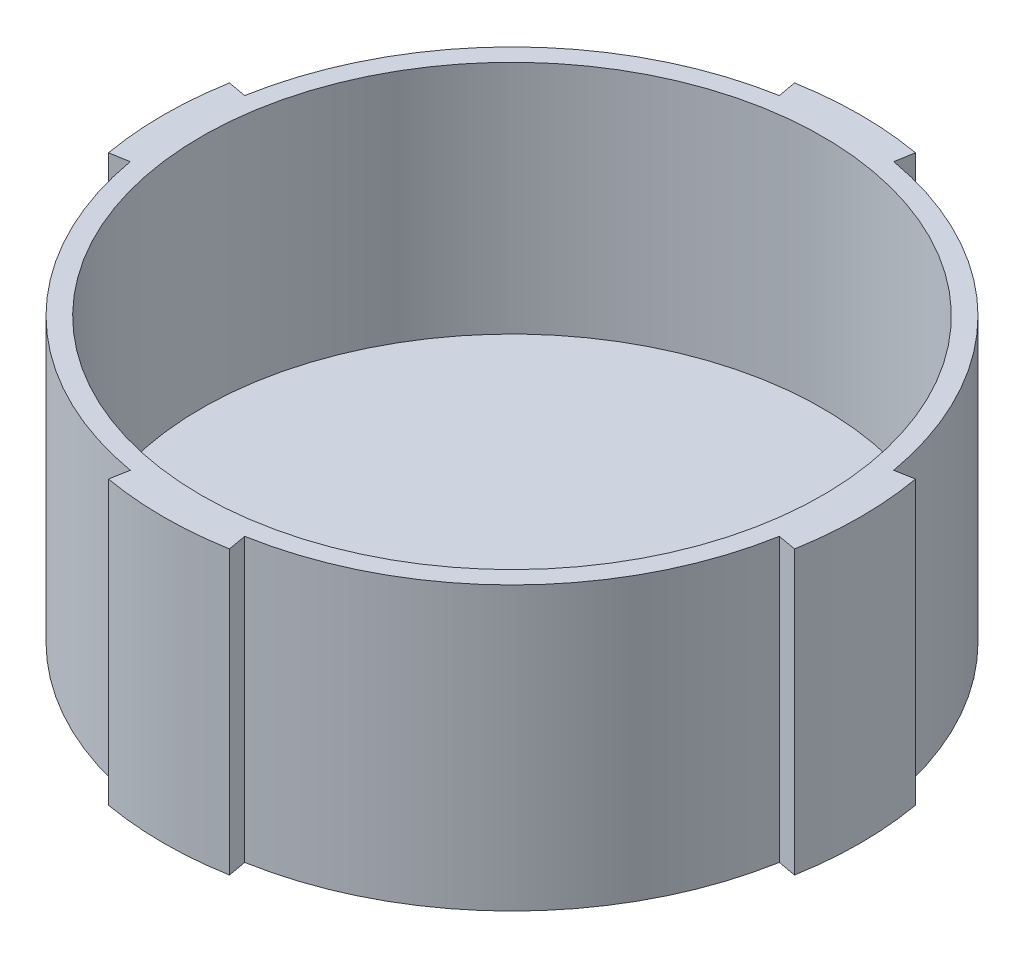
ISO-10303-21;
HEADER;
FILE_DESCRIPTION(('STEP AP214'),'2;1');
FILE_NAME('part.step','',(''),(''),'','','');
FILE_SCHEMA(('AUTOMOTIVE_DESIGN { 1 0 10303 214 1 1 1 1 }'));
ENDSEC;
DATA;
#1=APPLICATION_CONTEXT('core data for automotive mechanical design processes');
#2=APPLICATION_PROTOCOL_DEFINITION('international standard','automotive_design',2000,#1);
#3=PRODUCT_CONTEXT('',#1,'mechanical');
#4=PRODUCT('Part','Part','',(#3));
#5=PRODUCT_RELATED_PRODUCT_CATEGORY('part','',(#4));
#6=PRODUCT_DEFINITION_FORMATION('','',#4);
#7=PRODUCT_DEFINITION_CONTEXT('part definition',#1,'design');
#8=PRODUCT_DEFINITION('design','',#6,#7);
#9=PRODUCT_DEFINITION_SHAPE('','',#8);
#10=(LENGTH_UNIT() NAMED_UNIT(*) SI_UNIT(.MILLI.,.METRE.));
#11=(NAMED_UNIT(*) PLANE_ANGLE_UNIT() SI_UNIT($,.RADIAN.));
#12=(NAMED_UNIT(*) SI_UNIT($,.STERADIAN.) SOLID_ANGLE_UNIT());
#13=UNCERTAINTY_MEASURE_WITH_UNIT(LENGTH_MEASURE(1.E-05),#10,'distance_accuracy_value','');
#14=(GEOMETRIC_REPRESENTATION_CONTEXT(3) GLOBAL_UNCERTAINTY_ASSIGNED_CONTEXT((#13)) GLOBAL_UNIT_ASSIGNED_CONTEXT((#10,
#11,#12)) REPRESENTATION_CONTEXT('',''));
#15=CARTESIAN_POINT('',(0.,0.,0.));
#16=DIRECTION('',(0.,0.,1.));
#17=DIRECTION('',(1.,0.,0.));
#18=AXIS2_PLACEMENT_3D('',#15,#16,#17);
#19=CARTESIAN_POINT('',(0.,30.,0.));
#20=DIRECTION('',(0.,-1.,0.));
#21=DIRECTION('',(0.,0.,-1.));
#22=AXIS2_PLACEMENT_3D('',#19,#20,#21);
#23=CYLINDRICAL_SURFACE('',#22,37.);
#24=DIRECTION('',(0.,1.,0.));
#25=VECTOR('',#24,1.);
#26=CARTESIAN_POINT('',(36.4378868614517,0.,6.42498257367644));
#27=LINE('',#26,#25);
#28=CARTESIAN_POINT('',(36.4378868614517,0.,6.42498257367644));
#29=VERTEX_POINT('',#28);
#30=CARTESIAN_POINT('',(36.4378868614517,30.,6.42498257367644));
#31=VERTEX_POINT('',#30);
#32=EDGE_CURVE('E274',#29,#31,#27,.T.);
#33=ORIENTED_EDGE('',*,*,#32,.F.);
#34=CARTESIAN_POINT('',(0.,0.,0.));
#35=DIRECTION('',(0.,1.,0.));
#36=DIRECTION('',(0.,0.,1.));
#37=AXIS2_PLACEMENT_3D('',#34,#35,#36);
#38=CIRCLE('',#37,37.);
#39=CARTESIAN_POINT('',(36.4378868614517,0.,-6.42498257367646));
#40=VERTEX_POINT('',#39);
#41=EDGE_CURVE('E319',#29,#40,#38,.T.);
#42=ORIENTED_EDGE('',*,*,#41,.T.);
#43=DIRECTION('',(0.,1.,0.));
#44=VECTOR('',#43,1.);
#45=CARTESIAN_POINT('',(36.4378868614517,0.,-6.42498257367646));
#46=LINE('',#45,#44);
#47=CARTESIAN_POINT('',(36.4378868614517,30.,-6.42498257367646));
#48=VERTEX_POINT('',#47);
#49=EDGE_CURVE('E311',#40,#48,#46,.T.);
#50=ORIENTED_EDGE('',*,*,#49,.T.);
#51=CARTESIAN_POINT('',(0.,30.,0.));
#52=DIRECTION('',(0.,1.,0.));
#53=DIRECTION('',(0.,0.,1.));
#54=AXIS2_PLACEMENT_3D('',#51,#52,#53);
#55=CIRCLE('',#54,37.);
#56=EDGE_CURVE('E11',#31,#48,#55,.T.);
#57=ORIENTED_EDGE('',*,*,#56,.F.);
#58=EDGE_LOOP('',(#33,#42,#50,#57));
#59=FACE_BOUND('',#58,.T.);
#60=ADVANCED_FACE('F49',(#59),#23,.T.);
#61=CARTESIAN_POINT('',(-6.42498257367643,0.,36.4378868614517));
#62=VERTEX_POINT('',#61);
#63=CARTESIAN_POINT('',(6.42498257367646,0.,36.4378868614517));
#64=VERTEX_POINT('',#63);
#65=EDGE_CURVE('E52',#62,#64,#38,.T.);
#66=ORIENTED_EDGE('',*,*,#65,.T.);
#67=DIRECTION('',(0.,1.,0.));
#68=VECTOR('',#67,1.);
#69=CARTESIAN_POINT('',(6.42498257367646,0.,36.4378868614517));
#70=LINE('',#69,#68);
#71=CARTESIAN_POINT('',(6.42498257367646,30.,36.4378868614517));
#72=VERTEX_POINT('',#71);
#73=EDGE_CURVE('E277',#64,#72,#70,.T.);
#74=ORIENTED_EDGE('',*,*,#73,.T.);
#75=CARTESIAN_POINT('',(-6.42498257367643,30.,36.4378868614517));
#76=VERTEX_POINT('',#75);
#77=EDGE_CURVE('E59',#76,#72,#55,.T.);
#78=ORIENTED_EDGE('',*,*,#77,.F.);
#79=DIRECTION('',(0.,1.,0.));
#80=VECTOR('',#79,1.);
#81=CARTESIAN_POINT('',(-6.42498257367643,0.,36.4378868614517));
#82=LINE('',#81,#80);
#83=EDGE_CURVE('E241',#62,#76,#82,.T.);
#84=ORIENTED_EDGE('',*,*,#83,.F.);
#85=EDGE_LOOP('',(#66,#74,#78,#84));
#86=FACE_BOUND('',#85,.T.);
#87=ADVANCED_FACE('F371',(#86),#23,.T.);
#88=CARTESIAN_POINT('',(-36.4378868614517,0.,-6.42498257367643));
#89=VERTEX_POINT('',#88);
#90=CARTESIAN_POINT('',(-36.4378868614517,0.,6.42498257367646));
#91=VERTEX_POINT('',#90);
#92=EDGE_CURVE('E336',#89,#91,#38,.T.);
#93=ORIENTED_EDGE('',*,*,#92,.T.);
#94=DIRECTION('',(0.,1.,0.));
#95=VECTOR('',#94,1.);
#96=CARTESIAN_POINT('',(-36.4378868614517,0.,6.42498257367646));
#97=LINE('',#96,#95);
#98=CARTESIAN_POINT('',(-36.4378868614517,30.,6.42498257367646));
#99=VERTEX_POINT('',#98);
#100=EDGE_CURVE('E66',#91,#99,#97,.T.);
#101=ORIENTED_EDGE('',*,*,#100,.T.);
#102=CARTESIAN_POINT('',(-36.4378868614517,30.,-6.42498257367643));
#103=VERTEX_POINT('',#102);
#104=EDGE_CURVE('E318',#103,#99,#55,.T.);
#105=ORIENTED_EDGE('',*,*,#104,.F.);
#106=DIRECTION('',(0.,1.,0.));
#107=VECTOR('',#106,1.);
#108=CARTESIAN_POINT('',(-36.4378868614517,0.,-6.42498257367643));
#109=LINE('',#108,#107);
#110=EDGE_CURVE('E211',#89,#103,#109,.T.);
#111=ORIENTED_EDGE('',*,*,#110,.F.);
#112=EDGE_LOOP('',(#93,#101,#105,#111));
#113=FACE_BOUND('',#112,.T.);
#114=ADVANCED_FACE('F348',(#113),#23,.T.);
#115=CARTESIAN_POINT('',(6.42498257367644,0.,-36.4378868614517));
#116=VERTEX_POINT('',#115);
#117=CARTESIAN_POINT('',(-6.42498257367646,0.,-36.4378868614517));
#118=VERTEX_POINT('',#117);
#119=EDGE_CURVE('E329',#116,#118,#38,.T.);
#120=ORIENTED_EDGE('',*,*,#119,.T.);
#121=DIRECTION('',(0.,1.,0.));
#122=VECTOR('',#121,1.);
#123=CARTESIAN_POINT('',(-6.42498257367646,0.,-36.4378868614517));
#124=LINE('',#123,#122);
#125=CARTESIAN_POINT('',(-6.42498257367646,30.,-36.4378868614517));
#126=VERTEX_POINT('',#125);
#127=EDGE_CURVE('E74',#118,#126,#124,.T.);
#128=ORIENTED_EDGE('',*,*,#127,.T.);
#129=CARTESIAN_POINT('',(6.42498257367644,30.,-36.4378868614517));
#130=VERTEX_POINT('',#129);
#131=EDGE_CURVE('E58',#130,#126,#55,.T.);
#132=ORIENTED_EDGE('',*,*,#131,.F.);
#133=DIRECTION('',(0.,1.,0.));
#134=VECTOR('',#133,1.);
#135=CARTESIAN_POINT('',(6.42498257367644,0.,-36.4378868614517));
#136=LINE('',#135,#134);
#137=EDGE_CURVE('E308',#116,#130,#136,.T.);
#138=ORIENTED_EDGE('',*,*,#137,.F.);
#139=EDGE_LOOP('',(#120,#128,#132,#138));
#140=FACE_BOUND('',#139,.T.);
#141=ADVANCED_FACE('F372',(#140),#23,.T.);
#142=CARTESIAN_POINT('',(0.,30.,0.));
#143=DIRECTION('',(0.,1.,0.));
#144=DIRECTION('',(0.,0.,1.));
#145=AXIS2_PLACEMENT_3D('',#142,#143,#144);
#146=PLANE('',#145);
#147=CARTESIAN_POINT('',(0.,30.,0.));
#148=DIRECTION('',(0.,1.,0.));
#149=DIRECTION('',(0.,0.,1.));
#150=AXIS2_PLACEMENT_3D('',#147,#148,#149);
#151=CIRCLE('',#150,33.);
#152=CARTESIAN_POINT('',(0.,30.,33.));
#153=VERTEX_POINT('',#152);
#154=EDGE_CURVE('E198',#153,#153,#151,.T.);
#155=ORIENTED_EDGE('',*,*,#154,.F.);
#156=EDGE_LOOP('',(#155));
#157=FACE_BOUND('',#156,.T.);
#158=CARTESIAN_POINT('',(0.,30.,0.));
#159=DIRECTION('',(0.,1.,0.));
#160=DIRECTION('',(0.,0.,1.));
#161=AXIS2_PLACEMENT_3D('',#158,#159,#160);
#162=CIRCLE('',#161,35.);
#163=CARTESIAN_POINT('',(6.0776862183426,30.,34.4682713554273));
#164=VERTEX_POINT('',#163);
#165=CARTESIAN_POINT('',(34.4682713554273,30.,6.07768621834258));
#166=VERTEX_POINT('',#165);
#167=EDGE_CURVE('E260',#164,#166,#162,.T.);
#168=ORIENTED_EDGE('',*,*,#167,.T.);
#169=DIRECTION('',(0.984807753012208,0.,0.173648177666931));
#170=VECTOR('',#169,1.);
#171=CARTESIAN_POINT('',(0.,30.,0.));
#172=LINE('',#171,#170);
#173=EDGE_CURVE('E252',#166,#31,#172,.T.);
#174=ORIENTED_EDGE('',*,*,#173,.T.);
#175=ORIENTED_EDGE('',*,*,#56,.T.);
#176=DIRECTION('',(0.984807753012208,0.,-0.173648177666931));
#177=VECTOR('',#176,1.);
#178=CARTESIAN_POINT('',(0.,30.,0.));
#179=LINE('',#178,#177);
#180=CARTESIAN_POINT('',(34.4682713554273,30.,-6.0776862183426));
#181=VERTEX_POINT('',#180);
#182=EDGE_CURVE('E298',#181,#48,#179,.T.);
#183=ORIENTED_EDGE('',*,*,#182,.F.);
#184=CARTESIAN_POINT('',(0.,30.,0.));
#185=DIRECTION('',(0.,1.,0.));
#186=DIRECTION('',(0.,0.,1.));
#187=AXIS2_PLACEMENT_3D('',#184,#185,#186);
#188=CIRCLE('',#187,35.);
#189=CARTESIAN_POINT('',(6.07768621834258,30.,-34.4682713554273));
#190=VERTEX_POINT('',#189);
#191=EDGE_CURVE('E210',#181,#190,#188,.T.);
#192=ORIENTED_EDGE('',*,*,#191,.T.);
#193=DIRECTION('',(0.173648177666931,0.,-0.984807753012208));
#194=VECTOR('',#193,1.);
#195=CARTESIAN_POINT('',(0.,30.,0.));
#196=LINE('',#195,#194);
#197=EDGE_CURVE('E287',#190,#130,#196,.T.);
#198=ORIENTED_EDGE('',*,*,#197,.T.);
#199=ORIENTED_EDGE('',*,*,#131,.T.);
#200=DIRECTION('',(-0.173648177666931,0.,-0.984807753012208));
#201=VECTOR('',#200,1.);
#202=CARTESIAN_POINT('',(0.,30.,0.));
#203=LINE('',#202,#201);
#204=CARTESIAN_POINT('',(-6.0776862183426,30.,-34.4682713554273));
#205=VERTEX_POINT('',#204);
#206=EDGE_CURVE('E195',#205,#126,#203,.T.);
#207=ORIENTED_EDGE('',*,*,#206,.F.);
#208=CARTESIAN_POINT('',(0.,30.,0.));
#209=DIRECTION('',(0.,1.,0.));
#210=DIRECTION('',(0.,0.,1.));
#211=AXIS2_PLACEMENT_3D('',#208,#209,#210);
#212=CIRCLE('',#211,35.);
#213=CARTESIAN_POINT('',(-34.4682713554273,30.,-6.07768621834257));
#214=VERTEX_POINT('',#213);
#215=EDGE_CURVE('E172',#205,#214,#212,.T.);
#216=ORIENTED_EDGE('',*,*,#215,.T.);
#217=DIRECTION('',(-0.984807753012208,0.,-0.173648177666931));
#218=VECTOR('',#217,1.);
#219=CARTESIAN_POINT('',(0.,30.,0.));
#220=LINE('',#219,#218);
#221=EDGE_CURVE('E189',#214,#103,#220,.T.);
#222=ORIENTED_EDGE('',*,*,#221,.T.);
#223=ORIENTED_EDGE('',*,*,#104,.T.);
#224=DIRECTION('',(-0.984807753012208,0.,0.173648177666931));
#225=VECTOR('',#224,1.);
#226=CARTESIAN_POINT('',(0.,30.,0.));
#227=LINE('',#226,#225);
#228=CARTESIAN_POINT('',(-34.4682713554273,30.,6.0776862183426));
#229=VERTEX_POINT('',#228);
#230=EDGE_CURVE('E231',#229,#99,#227,.T.);
#231=ORIENTED_EDGE('',*,*,#230,.F.);
#232=CARTESIAN_POINT('',(0.,30.,0.));
#233=DIRECTION('',(0.,1.,0.));
#234=DIRECTION('',(0.,0.,1.));
#235=AXIS2_PLACEMENT_3D('',#232,#233,#234);
#236=CIRCLE('',#235,35.);
#237=CARTESIAN_POINT('',(-6.07768621834257,30.,34.4682713554273));
#238=VERTEX_POINT('',#237);
#239=EDGE_CURVE('E227',#229,#238,#236,.T.);
#240=ORIENTED_EDGE('',*,*,#239,.T.);
#241=DIRECTION('',(-0.173648177666931,0.,0.984807753012208));
#242=VECTOR('',#241,1.);
#243=CARTESIAN_POINT('',(0.,30.,0.));
#244=LINE('',#243,#242);
#245=EDGE_CURVE('E220',#238,#76,#244,.T.);
#246=ORIENTED_EDGE('',*,*,#245,.T.);
#247=ORIENTED_EDGE('',*,*,#77,.T.);
#248=DIRECTION('',(0.173648177666931,0.,0.984807753012208));
#249=VECTOR('',#248,1.);
#250=CARTESIAN_POINT('',(0.,30.,0.));
#251=LINE('',#250,#249);
#252=EDGE_CURVE('E264',#164,#72,#251,.T.);
#253=ORIENTED_EDGE('',*,*,#252,.F.);
#254=EDGE_LOOP('',(#168,#174,#175,#183,#192,#198,#199,#207,#216,#222,#223,#231,#240,#246,#247,#253));
#255=FACE_BOUND('',#254,.T.);
#256=ADVANCED_FACE('F358',(#157,#255),#146,.T.);
#257=CARTESIAN_POINT('',(0.,0.,0.));
#258=DIRECTION('',(0.,1.,0.));
#259=DIRECTION('',(0.,0.,1.));
#260=AXIS2_PLACEMENT_3D('',#257,#258,#259);
#261=PLANE('',#260);
#262=DIRECTION('',(0.984807753012208,0.,0.173648177666931));
#263=VECTOR('',#262,1.);
#264=CARTESIAN_POINT('',(0.,0.,0.));
#265=LINE('',#264,#263);
#266=CARTESIAN_POINT('',(34.4682713554273,0.,6.07768621834258));
#267=VERTEX_POINT('',#266);
#268=EDGE_CURVE('E256',#267,#29,#265,.T.);
#269=ORIENTED_EDGE('',*,*,#268,.F.);
#270=CARTESIAN_POINT('',(0.,0.,0.));
#271=DIRECTION('',(0.,1.,0.));
#272=DIRECTION('',(0.,0.,1.));
#273=AXIS2_PLACEMENT_3D('',#270,#271,#272);
#274=CIRCLE('',#273,35.);
#275=CARTESIAN_POINT('',(6.0776862183426,0.,34.4682713554273));
#276=VERTEX_POINT('',#275);
#277=EDGE_CURVE('E248',#276,#267,#274,.T.);
#278=ORIENTED_EDGE('',*,*,#277,.F.);
#279=DIRECTION('',(0.173648177666931,0.,0.984807753012208));
#280=VECTOR('',#279,1.);
#281=CARTESIAN_POINT('',(0.,0.,0.));
#282=LINE('',#281,#280);
#283=EDGE_CURVE('E251',#276,#64,#282,.T.);
#284=ORIENTED_EDGE('',*,*,#283,.T.);
#285=ORIENTED_EDGE('',*,*,#65,.F.);
#286=DIRECTION('',(-0.173648177666931,0.,0.984807753012208));
#287=VECTOR('',#286,1.);
#288=CARTESIAN_POINT('',(0.,0.,0.));
#289=LINE('',#288,#287);
#290=CARTESIAN_POINT('',(-6.07768621834257,0.,34.4682713554273));
#291=VERTEX_POINT('',#290);
#292=EDGE_CURVE('E223',#291,#62,#289,.T.);
#293=ORIENTED_EDGE('',*,*,#292,.F.);
#294=CARTESIAN_POINT('',(0.,0.,0.));
#295=DIRECTION('',(0.,1.,0.));
#296=DIRECTION('',(0.,0.,1.));
#297=AXIS2_PLACEMENT_3D('',#294,#295,#296);
#298=CIRCLE('',#297,35.);
#299=CARTESIAN_POINT('',(-34.4682713554273,0.,6.0776862183426));
#300=VERTEX_POINT('',#299);
#301=EDGE_CURVE('E216',#300,#291,#298,.T.);
#302=ORIENTED_EDGE('',*,*,#301,.F.);
#303=DIRECTION('',(-0.984807753012208,0.,0.173648177666931));
#304=VECTOR('',#303,1.);
#305=CARTESIAN_POINT('',(0.,0.,0.));
#306=LINE('',#305,#304);
#307=EDGE_CURVE('E219',#300,#91,#306,.T.);
#308=ORIENTED_EDGE('',*,*,#307,.T.);
#309=ORIENTED_EDGE('',*,*,#92,.F.);
#310=DIRECTION('',(-0.984807753012208,0.,-0.173648177666931));
#311=VECTOR('',#310,1.);
#312=CARTESIAN_POINT('',(0.,0.,0.));
#313=LINE('',#312,#311);
#314=CARTESIAN_POINT('',(-34.4682713554273,0.,-6.07768621834257));
#315=VERTEX_POINT('',#314);
#316=EDGE_CURVE('E175',#315,#89,#313,.T.);
#317=ORIENTED_EDGE('',*,*,#316,.F.);
#318=CARTESIAN_POINT('',(0.,0.,0.));
#319=DIRECTION('',(0.,1.,0.));
#320=DIRECTION('',(0.,0.,1.));
#321=AXIS2_PLACEMENT_3D('',#318,#319,#320);
#322=CIRCLE('',#321,35.);
#323=CARTESIAN_POINT('',(-6.0776862183426,0.,-34.4682713554273));
#324=VERTEX_POINT('',#323);
#325=EDGE_CURVE('E169',#324,#315,#322,.T.);
#326=ORIENTED_EDGE('',*,*,#325,.F.);
#327=DIRECTION('',(-0.173648177666931,0.,-0.984807753012208));
#328=VECTOR('',#327,1.);
#329=CARTESIAN_POINT('',(0.,0.,0.));
#330=LINE('',#329,#328);
#331=EDGE_CURVE('E177',#324,#118,#330,.T.);
#332=ORIENTED_EDGE('',*,*,#331,.T.);
#333=ORIENTED_EDGE('',*,*,#119,.F.);
#334=DIRECTION('',(0.173648177666931,0.,-0.984807753012208));
#335=VECTOR('',#334,1.);
#336=CARTESIAN_POINT('',(0.,0.,0.));
#337=LINE('',#336,#335);
#338=CARTESIAN_POINT('',(6.07768621834258,0.,-34.4682713554273));
#339=VERTEX_POINT('',#338);
#340=EDGE_CURVE('E291',#339,#116,#337,.T.);
#341=ORIENTED_EDGE('',*,*,#340,.F.);
#342=CARTESIAN_POINT('',(0.,0.,0.));
#343=DIRECTION('',(0.,1.,0.));
#344=DIRECTION('',(0.,0.,1.));
#345=AXIS2_PLACEMENT_3D('',#342,#343,#344);
#346=CIRCLE('',#345,35.);
#347=CARTESIAN_POINT('',(34.4682713554273,0.,-6.0776862183426));
#348=VERTEX_POINT('',#347);
#349=EDGE_CURVE('E283',#348,#339,#346,.T.);
#350=ORIENTED_EDGE('',*,*,#349,.F.);
#351=DIRECTION('',(0.984807753012208,0.,-0.173648177666931));
#352=VECTOR('',#351,1.);
#353=CARTESIAN_POINT('',(0.,0.,0.));
#354=LINE('',#353,#352);
#355=EDGE_CURVE('E286',#348,#40,#354,.T.);
#356=ORIENTED_EDGE('',*,*,#355,.T.);
#357=ORIENTED_EDGE('',*,*,#41,.F.);
#358=EDGE_LOOP('',(#269,#278,#284,#285,#293,#302,#308,#309,#317,#326,#332,#333,#341,#350,#356,#357));
#359=FACE_BOUND('',#358,.T.);
#360=ADVANCED_FACE('F186',(#359),#261,.F.);
#361=CARTESIAN_POINT('',(0.,0.,0.));
#362=DIRECTION('',(0.,1.,0.));
#363=DIRECTION('',(0.,0.,1.));
#364=AXIS2_PLACEMENT_3D('',#361,#362,#363);
#365=CYLINDRICAL_SURFACE('',#364,35.);
#366=ORIENTED_EDGE('',*,*,#191,.F.);
#367=DIRECTION('',(0.,1.,0.));
#368=VECTOR('',#367,1.);
#369=CARTESIAN_POINT('',(34.4682713554273,0.,-6.0776862183426));
#370=LINE('',#369,#368);
#371=EDGE_CURVE('E294',#348,#181,#370,.T.);
#372=ORIENTED_EDGE('',*,*,#371,.F.);
#373=ORIENTED_EDGE('',*,*,#349,.T.);
#374=DIRECTION('',(0.,1.,0.));
#375=VECTOR('',#374,1.);
#376=CARTESIAN_POINT('',(6.07768621834258,0.,-34.4682713554273));
#377=LINE('',#376,#375);
#378=EDGE_CURVE('E304',#339,#190,#377,.T.);
#379=ORIENTED_EDGE('',*,*,#378,.T.);
#380=EDGE_LOOP('',(#366,#372,#373,#379));
#381=FACE_BOUND('',#380,.T.);
#382=ADVANCED_FACE('F392',(#381),#365,.T.);
#383=CARTESIAN_POINT('',(0.,0.,0.));
#384=DIRECTION('',(0.984807753012208,0.,0.173648177666931));
#385=DIRECTION('',(0.173648177666931,0.,-0.984807753012208));
#386=AXIS2_PLACEMENT_3D('',#383,#384,#385);
#387=PLANE('',#386);
#388=ORIENTED_EDGE('',*,*,#197,.F.);
#389=ORIENTED_EDGE('',*,*,#378,.F.);
#390=ORIENTED_EDGE('',*,*,#340,.T.);
#391=ORIENTED_EDGE('',*,*,#137,.T.);
#392=EDGE_LOOP('',(#388,#389,#390,#391));
#393=FACE_BOUND('',#392,.T.);
#394=ADVANCED_FACE('F389',(#393),#387,.T.);
#395=CARTESIAN_POINT('',(0.,0.,0.));
#396=DIRECTION('',(0.173648177666931,0.,0.984807753012208));
#397=DIRECTION('',(0.984807753012208,0.,-0.173648177666931));
#398=AXIS2_PLACEMENT_3D('',#395,#396,#397);
#399=PLANE('',#398);
#400=ORIENTED_EDGE('',*,*,#182,.T.);
#401=ORIENTED_EDGE('',*,*,#49,.F.);
#402=ORIENTED_EDGE('',*,*,#355,.F.);
#403=ORIENTED_EDGE('',*,*,#371,.T.);
#404=EDGE_LOOP('',(#400,#401,#402,#403));
#405=FACE_BOUND('',#404,.T.);
#406=ADVANCED_FACE('F367',(#405),#399,.F.);
#407=CARTESIAN_POINT('',(0.,0.,0.));
#408=DIRECTION('',(0.,1.,0.));
#409=DIRECTION('',(0.,0.,1.));
#410=AXIS2_PLACEMENT_3D('',#407,#408,#409);
#411=CYLINDRICAL_SURFACE('',#410,35.);
#412=ORIENTED_EDGE('',*,*,#215,.F.);
#413=DIRECTION('',(0.,1.,0.));
#414=VECTOR('',#413,1.);
#415=CARTESIAN_POINT('',(-6.0776862183426,0.,-34.4682713554273));
#416=LINE('',#415,#414);
#417=EDGE_CURVE('E165',#324,#205,#416,.T.);
#418=ORIENTED_EDGE('',*,*,#417,.F.);
#419=ORIENTED_EDGE('',*,*,#325,.T.);
#420=DIRECTION('',(0.,1.,0.));
#421=VECTOR('',#420,1.);
#422=CARTESIAN_POINT('',(-34.4682713554273,0.,-6.07768621834257));
#423=LINE('',#422,#421);
#424=EDGE_CURVE('E208',#315,#214,#423,.T.);
#425=ORIENTED_EDGE('',*,*,#424,.T.);
#426=EDGE_LOOP('',(#412,#418,#419,#425));
#427=FACE_BOUND('',#426,.T.);
#428=ADVANCED_FACE('F166',(#427),#411,.T.);
#429=CARTESIAN_POINT('',(0.,0.,0.));
#430=DIRECTION('',(0.173648177666931,0.,-0.984807753012208));
#431=DIRECTION('',(-0.984807753012208,0.,-0.173648177666931));
#432=AXIS2_PLACEMENT_3D('',#429,#430,#431);
#433=PLANE('',#432);
#434=ORIENTED_EDGE('',*,*,#221,.F.);
#435=ORIENTED_EDGE('',*,*,#424,.F.);
#436=ORIENTED_EDGE('',*,*,#316,.T.);
#437=ORIENTED_EDGE('',*,*,#110,.T.);
#438=EDGE_LOOP('',(#434,#435,#436,#437));
#439=FACE_BOUND('',#438,.T.);
#440=ADVANCED_FACE('F360',(#439),#433,.T.);
#441=CARTESIAN_POINT('',(0.,0.,0.));
#442=DIRECTION('',(0.984807753012208,0.,-0.173648177666931));
#443=DIRECTION('',(-0.173648177666931,0.,-0.984807753012208));
#444=AXIS2_PLACEMENT_3D('',#441,#442,#443);
#445=PLANE('',#444);
#446=ORIENTED_EDGE('',*,*,#206,.T.);
#447=ORIENTED_EDGE('',*,*,#127,.F.);
#448=ORIENTED_EDGE('',*,*,#331,.F.);
#449=ORIENTED_EDGE('',*,*,#417,.T.);
#450=EDGE_LOOP('',(#446,#447,#448,#449));
#451=FACE_BOUND('',#450,.T.);
#452=ADVANCED_FACE('F178',(#451),#445,.F.);
#453=CARTESIAN_POINT('',(0.,0.,0.));
#454=DIRECTION('',(0.,1.,0.));
#455=DIRECTION('',(0.,0.,1.));
#456=AXIS2_PLACEMENT_3D('',#453,#454,#455);
#457=CYLINDRICAL_SURFACE('',#456,35.);
#458=ORIENTED_EDGE('',*,*,#239,.F.);
#459=DIRECTION('',(0.,1.,0.));
#460=VECTOR('',#459,1.);
#461=CARTESIAN_POINT('',(-34.4682713554273,0.,6.0776862183426));
#462=LINE('',#461,#460);
#463=EDGE_CURVE('E226',#300,#229,#462,.T.);
#464=ORIENTED_EDGE('',*,*,#463,.F.);
#465=ORIENTED_EDGE('',*,*,#301,.T.);
#466=DIRECTION('',(0.,1.,0.));
#467=VECTOR('',#466,1.);
#468=CARTESIAN_POINT('',(-6.07768621834257,0.,34.4682713554273));
#469=LINE('',#468,#467);
#470=EDGE_CURVE('E205',#291,#238,#469,.T.);
#471=ORIENTED_EDGE('',*,*,#470,.T.);
#472=EDGE_LOOP('',(#458,#464,#465,#471));
#473=FACE_BOUND('',#472,.T.);
#474=ADVANCED_FACE('F356',(#473),#457,.T.);
#475=CARTESIAN_POINT('',(0.,0.,0.));
#476=DIRECTION('',(-0.984807753012208,0.,-0.173648177666931));
#477=DIRECTION('',(-0.173648177666931,0.,0.984807753012208));
#478=AXIS2_PLACEMENT_3D('',#475,#476,#477);
#479=PLANE('',#478);
#480=ORIENTED_EDGE('',*,*,#245,.F.);
#481=ORIENTED_EDGE('',*,*,#470,.F.);
#482=ORIENTED_EDGE('',*,*,#292,.T.);
#483=ORIENTED_EDGE('',*,*,#83,.T.);
#484=EDGE_LOOP('',(#480,#481,#482,#483));
#485=FACE_BOUND('',#484,.T.);
#486=ADVANCED_FACE('F408',(#485),#479,.T.);
#487=CARTESIAN_POINT('',(0.,0.,0.));
#488=DIRECTION('',(-0.173648177666931,0.,-0.984807753012208));
#489=DIRECTION('',(-0.984807753012208,0.,0.173648177666931));
#490=AXIS2_PLACEMENT_3D('',#487,#488,#489);
#491=PLANE('',#490);
#492=ORIENTED_EDGE('',*,*,#230,.T.);
#493=ORIENTED_EDGE('',*,*,#100,.F.);
#494=ORIENTED_EDGE('',*,*,#307,.F.);
#495=ORIENTED_EDGE('',*,*,#463,.T.);
#496=EDGE_LOOP('',(#492,#493,#494,#495));
#497=FACE_BOUND('',#496,.T.);
#498=ADVANCED_FACE('F352',(#497),#491,.F.);
#499=CARTESIAN_POINT('',(0.,0.,0.));
#500=DIRECTION('',(0.,1.,0.));
#501=DIRECTION('',(0.,0.,1.));
#502=AXIS2_PLACEMENT_3D('',#499,#500,#501);
#503=CYLINDRICAL_SURFACE('',#502,35.);
#504=ORIENTED_EDGE('',*,*,#167,.F.);
#505=DIRECTION('',(0.,1.,0.));
#506=VECTOR('',#505,1.);
#507=CARTESIAN_POINT('',(6.0776862183426,0.,34.4682713554273));
#508=LINE('',#507,#506);
#509=EDGE_CURVE('E259',#276,#164,#508,.T.);
#510=ORIENTED_EDGE('',*,*,#509,.F.);
#511=ORIENTED_EDGE('',*,*,#277,.T.);
#512=DIRECTION('',(0.,1.,0.));
#513=VECTOR('',#512,1.);
#514=CARTESIAN_POINT('',(34.4682713554273,0.,6.07768621834258));
#515=LINE('',#514,#513);
#516=EDGE_CURVE('E232',#267,#166,#515,.T.);
#517=ORIENTED_EDGE('',*,*,#516,.T.);
#518=EDGE_LOOP('',(#504,#510,#511,#517));
#519=FACE_BOUND('',#518,.T.);
#520=ADVANCED_FACE('F403',(#519),#503,.T.);
#521=CARTESIAN_POINT('',(0.,0.,0.));
#522=DIRECTION('',(-0.173648177666931,0.,0.984807753012208));
#523=DIRECTION('',(0.984807753012208,0.,0.173648177666931));
#524=AXIS2_PLACEMENT_3D('',#521,#522,#523);
#525=PLANE('',#524);
#526=ORIENTED_EDGE('',*,*,#173,.F.);
#527=ORIENTED_EDGE('',*,*,#516,.F.);
#528=ORIENTED_EDGE('',*,*,#268,.T.);
#529=ORIENTED_EDGE('',*,*,#32,.T.);
#530=EDGE_LOOP('',(#526,#527,#528,#529));
#531=FACE_BOUND('',#530,.T.);
#532=ADVANCED_FACE('F400',(#531),#525,.T.);
#533=CARTESIAN_POINT('',(0.,0.,0.));
#534=DIRECTION('',(-0.984807753012208,0.,0.173648177666931));
#535=DIRECTION('',(0.173648177666931,0.,0.984807753012208));
#536=AXIS2_PLACEMENT_3D('',#533,#534,#535);
#537=PLANE('',#536);
#538=ORIENTED_EDGE('',*,*,#252,.T.);
#539=ORIENTED_EDGE('',*,*,#73,.F.);
#540=ORIENTED_EDGE('',*,*,#283,.F.);
#541=ORIENTED_EDGE('',*,*,#509,.T.);
#542=EDGE_LOOP('',(#538,#539,#540,#541));
#543=FACE_BOUND('',#542,.T.);
#544=ADVANCED_FACE('F405',(#543),#537,.F.);
#545=CARTESIAN_POINT('',(0.,5.00000000000001,0.));
#546=DIRECTION('',(0.,1.,0.));
#547=DIRECTION('',(0.,0.,1.));
#548=AXIS2_PLACEMENT_3D('',#545,#546,#547);
#549=CYLINDRICAL_SURFACE('',#548,33.);
#550=CARTESIAN_POINT('',(0.,5.00000000000001,0.));
#551=DIRECTION('',(0.,1.,0.));
#552=DIRECTION('',(0.,0.,1.));
#553=AXIS2_PLACEMENT_3D('',#550,#551,#552);
#554=CIRCLE('',#553,33.);
#555=CARTESIAN_POINT('',(0.,5.00000000000001,33.));
#556=VERTEX_POINT('',#555);
#557=EDGE_CURVE('E265',#556,#556,#554,.T.);
#558=ORIENTED_EDGE('',*,*,#557,.F.);
#559=EDGE_LOOP('',(#558));
#560=FACE_BOUND('',#559,.T.);
#561=ORIENTED_EDGE('',*,*,#154,.T.);
#562=EDGE_LOOP('',(#561));
#563=FACE_BOUND('',#562,.T.);
#564=ADVANCED_FACE('F421',(#560,#563),#549,.F.);
#565=CARTESIAN_POINT('',(0.,5.00000000000001,0.));
#566=DIRECTION('',(0.,1.,0.));
#567=DIRECTION('',(0.,0.,1.));
#568=AXIS2_PLACEMENT_3D('',#565,#566,#567);
#569=PLANE('',#568);
#570=ORIENTED_EDGE('',*,*,#557,.T.);
#571=EDGE_LOOP('',(#570));
#572=FACE_BOUND('',#571,.T.);
#573=ADVANCED_FACE('F506',(#572),#569,.T.);
#574=CLOSED_SHELL('',(#60,#87,#114,#141,#256,#360,#382,#394,#406,#428,#440,#452,#474,#486,#498,
#520,#532,#544,#564,#573));
#575=MANIFOLD_SOLID_BREP('B2',#574);
#576=ADVANCED_BREP_SHAPE_REPRESENTATION('',(#18,#575),#14);
#577=SHAPE_DEFINITION_REPRESENTATION(#9,#576);
ENDSEC;
END-ISO-10303-21;
